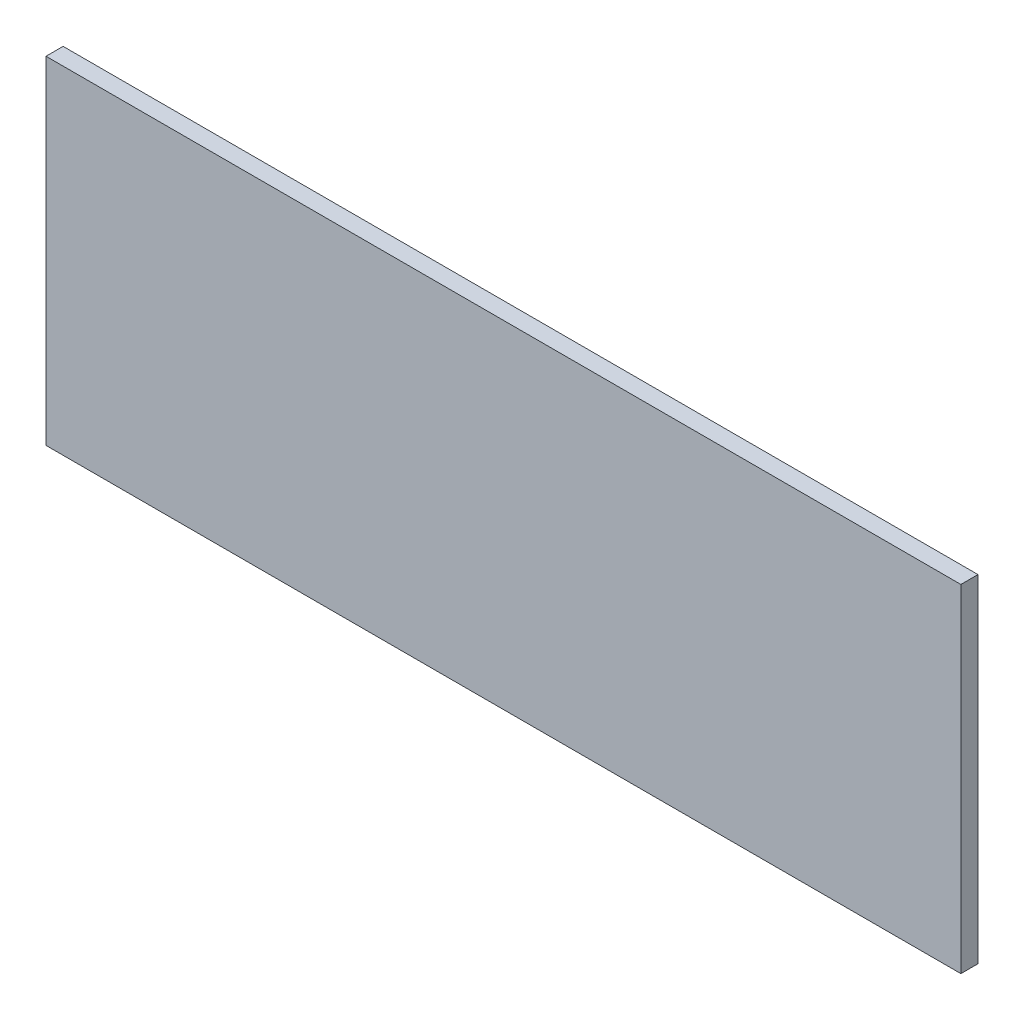
ISO-10303-21;
HEADER;
FILE_DESCRIPTION(('STEP AP214'),'2;1');
FILE_NAME('part.step','',(''),(''),'','','');
FILE_SCHEMA(('AUTOMOTIVE_DESIGN { 1 0 10303 214 1 1 1 1 }'));
ENDSEC;
DATA;
#1=APPLICATION_CONTEXT('core data for automotive mechanical design processes');
#2=APPLICATION_PROTOCOL_DEFINITION('international standard','automotive_design',2000,#1);
#3=PRODUCT_CONTEXT('',#1,'mechanical');
#4=PRODUCT('Part','Part','',(#3));
#5=PRODUCT_RELATED_PRODUCT_CATEGORY('part','',(#4));
#6=PRODUCT_DEFINITION_FORMATION('','',#4);
#7=PRODUCT_DEFINITION_CONTEXT('part definition',#1,'design');
#8=PRODUCT_DEFINITION('design','',#6,#7);
#9=PRODUCT_DEFINITION_SHAPE('','',#8);
#10=(LENGTH_UNIT() NAMED_UNIT(*) SI_UNIT(.MILLI.,.METRE.));
#11=(NAMED_UNIT(*) PLANE_ANGLE_UNIT() SI_UNIT($,.RADIAN.));
#12=(NAMED_UNIT(*) SI_UNIT($,.STERADIAN.) SOLID_ANGLE_UNIT());
#13=UNCERTAINTY_MEASURE_WITH_UNIT(LENGTH_MEASURE(1.E-05),#10,'distance_accuracy_value','');
#14=(GEOMETRIC_REPRESENTATION_CONTEXT(3) GLOBAL_UNCERTAINTY_ASSIGNED_CONTEXT((#13)) GLOBAL_UNIT_ASSIGNED_CONTEXT((#10,
#11,#12)) REPRESENTATION_CONTEXT('',''));
#15=CARTESIAN_POINT('',(0.,0.,0.));
#16=DIRECTION('',(0.,0.,1.));
#17=DIRECTION('',(1.,0.,0.));
#18=AXIS2_PLACEMENT_3D('',#15,#16,#17);
#19=CARTESIAN_POINT('',(81.8669967651367,67.5869979858398,0.));
#20=DIRECTION('',(0.,1.,0.));
#21=DIRECTION('',(1.,0.,0.));
#22=AXIS2_PLACEMENT_3D('',#19,#20,#21);
#23=PLANE('',#22);
#24=DIRECTION('',(1.,0.,0.));
#25=VECTOR('',#24,1.);
#26=CARTESIAN_POINT('',(81.8669967651367,67.5869979858398,0.03556));
#27=LINE('',#26,#25);
#28=CARTESIAN_POINT('',(81.8669967651367,67.5869979858398,0.03556));
#29=VERTEX_POINT('',#28);
#30=CARTESIAN_POINT('',(83.7669982910156,67.5869979858398,0.03556));
#31=VERTEX_POINT('',#30);
#32=EDGE_CURVE('E11',#29,#31,#27,.T.);
#33=ORIENTED_EDGE('',*,*,#32,.F.);
#34=DIRECTION('',(0.,0.,1.));
#35=VECTOR('',#34,1.);
#36=CARTESIAN_POINT('',(81.8669967651367,67.5869979858398,0.));
#37=LINE('',#36,#35);
#38=CARTESIAN_POINT('',(81.8669967651367,67.5869979858398,0.));
#39=VERTEX_POINT('',#38);
#40=EDGE_CURVE('E24',#39,#29,#37,.T.);
#41=ORIENTED_EDGE('',*,*,#40,.F.);
#42=DIRECTION('',(1.,0.,0.));
#43=VECTOR('',#42,1.);
#44=CARTESIAN_POINT('',(81.8669967651367,67.5869979858398,0.));
#45=LINE('',#44,#43);
#46=CARTESIAN_POINT('',(83.7669982910156,67.5869979858398,0.));
#47=VERTEX_POINT('',#46);
#48=EDGE_CURVE('E75',#39,#47,#45,.T.);
#49=ORIENTED_EDGE('',*,*,#48,.T.);
#50=DIRECTION('',(0.,0.,1.));
#51=VECTOR('',#50,1.);
#52=CARTESIAN_POINT('',(83.7669982910156,67.5869979858398,0.));
#53=LINE('',#52,#51);
#54=EDGE_CURVE('E37',#47,#31,#53,.T.);
#55=ORIENTED_EDGE('',*,*,#54,.T.);
#56=EDGE_LOOP('',(#33,#41,#49,#55));
#57=FACE_BOUND('',#56,.T.);
#58=ADVANCED_FACE('F17',(#57),#23,.F.);
#59=CARTESIAN_POINT('',(83.7669982910156,67.5869979858398,0.));
#60=DIRECTION('',(-1.,0.,0.));
#61=DIRECTION('',(0.,1.,0.));
#62=AXIS2_PLACEMENT_3D('',#59,#60,#61);
#63=PLANE('',#62);
#64=DIRECTION('',(0.,1.,0.));
#65=VECTOR('',#64,1.);
#66=CARTESIAN_POINT('',(83.7669982910156,67.5869979858398,0.03556));
#67=LINE('',#66,#65);
#68=CARTESIAN_POINT('',(83.7669982910156,68.2870025634766,0.03556));
#69=VERTEX_POINT('',#68);
#70=EDGE_CURVE('E83',#31,#69,#67,.T.);
#71=ORIENTED_EDGE('',*,*,#70,.F.);
#72=ORIENTED_EDGE('',*,*,#54,.F.);
#73=DIRECTION('',(0.,1.,0.));
#74=VECTOR('',#73,1.);
#75=CARTESIAN_POINT('',(83.7669982910156,67.5869979858398,0.));
#76=LINE('',#75,#74);
#77=CARTESIAN_POINT('',(83.7669982910156,68.2870025634766,0.));
#78=VERTEX_POINT('',#77);
#79=EDGE_CURVE('E81',#47,#78,#76,.T.);
#80=ORIENTED_EDGE('',*,*,#79,.T.);
#81=DIRECTION('',(0.,0.,1.));
#82=VECTOR('',#81,1.);
#83=CARTESIAN_POINT('',(83.7669982910156,68.2870025634766,0.));
#84=LINE('',#83,#82);
#85=EDGE_CURVE('E67',#78,#69,#84,.T.);
#86=ORIENTED_EDGE('',*,*,#85,.T.);
#87=EDGE_LOOP('',(#71,#72,#80,#86));
#88=FACE_BOUND('',#87,.T.);
#89=ADVANCED_FACE('F89',(#88),#63,.F.);
#90=CARTESIAN_POINT('',(83.7669982910156,68.2870025634766,0.));
#91=DIRECTION('',(0.,-1.,0.));
#92=DIRECTION('',(-1.,0.,0.));
#93=AXIS2_PLACEMENT_3D('',#90,#91,#92);
#94=PLANE('',#93);
#95=DIRECTION('',(-1.,0.,0.));
#96=VECTOR('',#95,1.);
#97=CARTESIAN_POINT('',(83.7669982910156,68.2870025634766,0.03556));
#98=LINE('',#97,#96);
#99=CARTESIAN_POINT('',(81.8669967651367,68.2870025634766,0.03556));
#100=VERTEX_POINT('',#99);
#101=EDGE_CURVE('E71',#69,#100,#98,.T.);
#102=ORIENTED_EDGE('',*,*,#101,.F.);
#103=ORIENTED_EDGE('',*,*,#85,.F.);
#104=DIRECTION('',(-1.,0.,0.));
#105=VECTOR('',#104,1.);
#106=CARTESIAN_POINT('',(83.7669982910156,68.2870025634766,0.));
#107=LINE('',#106,#105);
#108=CARTESIAN_POINT('',(81.8669967651367,68.2870025634766,0.));
#109=VERTEX_POINT('',#108);
#110=EDGE_CURVE('E63',#78,#109,#107,.T.);
#111=ORIENTED_EDGE('',*,*,#110,.T.);
#112=DIRECTION('',(0.,0.,1.));
#113=VECTOR('',#112,1.);
#114=CARTESIAN_POINT('',(81.8669967651367,68.2870025634766,0.));
#115=LINE('',#114,#113);
#116=EDGE_CURVE('E53',#109,#100,#115,.T.);
#117=ORIENTED_EDGE('',*,*,#116,.T.);
#118=EDGE_LOOP('',(#102,#103,#111,#117));
#119=FACE_BOUND('',#118,.T.);
#120=ADVANCED_FACE('F66',(#119),#94,.F.);
#121=CARTESIAN_POINT('',(81.8669967651367,68.2870025634766,0.));
#122=DIRECTION('',(1.,0.,0.));
#123=DIRECTION('',(0.,-1.,0.));
#124=AXIS2_PLACEMENT_3D('',#121,#122,#123);
#125=PLANE('',#124);
#126=DIRECTION('',(0.,-1.,0.));
#127=VECTOR('',#126,1.);
#128=CARTESIAN_POINT('',(81.8669967651367,68.2870025634766,0.03556));
#129=LINE('',#128,#127);
#130=EDGE_CURVE('E59',#100,#29,#129,.T.);
#131=ORIENTED_EDGE('',*,*,#130,.F.);
#132=ORIENTED_EDGE('',*,*,#116,.F.);
#133=DIRECTION('',(0.,-1.,0.));
#134=VECTOR('',#133,1.);
#135=CARTESIAN_POINT('',(81.8669967651367,68.2870025634766,0.));
#136=LINE('',#135,#134);
#137=EDGE_CURVE('E57',#109,#39,#136,.T.);
#138=ORIENTED_EDGE('',*,*,#137,.T.);
#139=ORIENTED_EDGE('',*,*,#40,.T.);
#140=EDGE_LOOP('',(#131,#132,#138,#139));
#141=FACE_BOUND('',#140,.T.);
#142=ADVANCED_FACE('F55',(#141),#125,.F.);
#143=CARTESIAN_POINT('',(81.8669967651367,67.5869979858398,0.));
#144=DIRECTION('',(0.,0.,-1.));
#145=DIRECTION('',(-1.,0.,0.));
#146=AXIS2_PLACEMENT_3D('',#143,#144,#145);
#147=PLANE('',#146);
#148=ORIENTED_EDGE('',*,*,#137,.F.);
#149=ORIENTED_EDGE('',*,*,#110,.F.);
#150=ORIENTED_EDGE('',*,*,#79,.F.);
#151=ORIENTED_EDGE('',*,*,#48,.F.);
#152=EDGE_LOOP('',(#148,#149,#150,#151));
#153=FACE_BOUND('',#152,.T.);
#154=ADVANCED_FACE('F74',(#153),#147,.T.);
#155=CARTESIAN_POINT('',(81.8669967651367,67.5869979858398,0.03556));
#156=DIRECTION('',(0.,0.,-1.));
#157=DIRECTION('',(-1.,0.,0.));
#158=AXIS2_PLACEMENT_3D('',#155,#156,#157);
#159=PLANE('',#158);
#160=ORIENTED_EDGE('',*,*,#32,.T.);
#161=ORIENTED_EDGE('',*,*,#70,.T.);
#162=ORIENTED_EDGE('',*,*,#101,.T.);
#163=ORIENTED_EDGE('',*,*,#130,.T.);
#164=EDGE_LOOP('',(#160,#161,#162,#163));
#165=FACE_BOUND('',#164,.T.);
#166=ADVANCED_FACE('F91',(#165),#159,.F.);
#167=CLOSED_SHELL('',(#58,#89,#120,#142,#154,#166));
#168=MANIFOLD_SOLID_BREP('B1',#167);
#169=ADVANCED_BREP_SHAPE_REPRESENTATION('',(#18,#168),#14);
#170=SHAPE_DEFINITION_REPRESENTATION(#9,#169);
ENDSEC;
END-ISO-10303-21;
